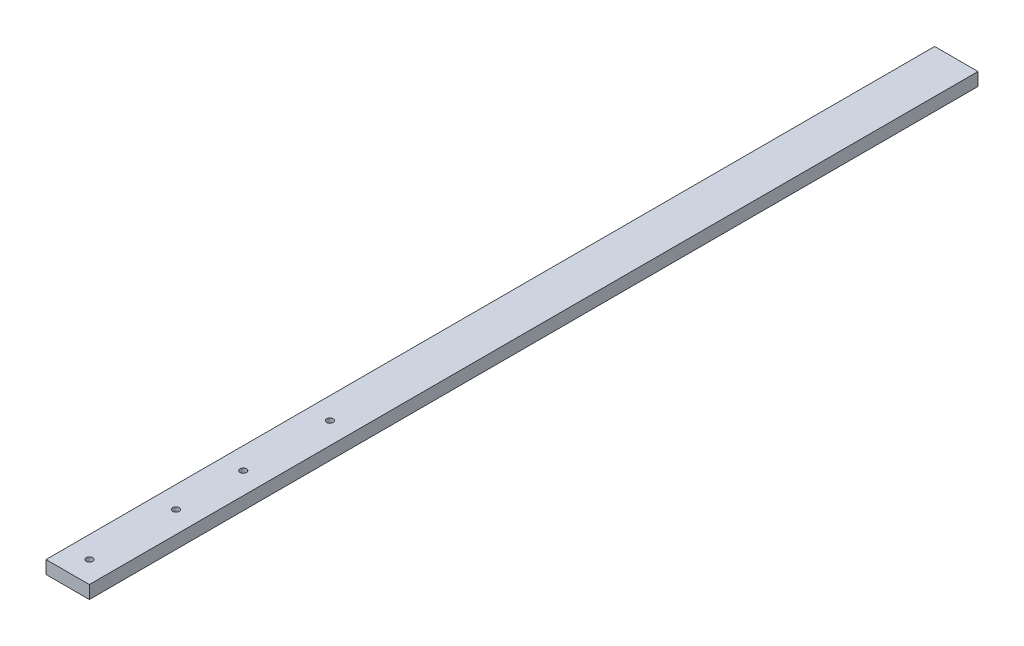
ISO-10303-21;
HEADER;
FILE_DESCRIPTION(('STEP AP214'),'2;1');
FILE_NAME('part.step','',(''),(''),'','','');
FILE_SCHEMA(('AUTOMOTIVE_DESIGN { 1 0 10303 214 1 1 1 1 }'));
ENDSEC;
DATA;
#1=APPLICATION_CONTEXT('core data for automotive mechanical design processes');
#2=APPLICATION_PROTOCOL_DEFINITION('international standard','automotive_design',2000,#1);
#3=PRODUCT_CONTEXT('',#1,'mechanical');
#4=PRODUCT('Part','Part','',(#3));
#5=PRODUCT_RELATED_PRODUCT_CATEGORY('part','',(#4));
#6=PRODUCT_DEFINITION_FORMATION('','',#4);
#7=PRODUCT_DEFINITION_CONTEXT('part definition',#1,'design');
#8=PRODUCT_DEFINITION('design','',#6,#7);
#9=PRODUCT_DEFINITION_SHAPE('','',#8);
#10=(LENGTH_UNIT() NAMED_UNIT(*) SI_UNIT(.MILLI.,.METRE.));
#11=(NAMED_UNIT(*) PLANE_ANGLE_UNIT() SI_UNIT($,.RADIAN.));
#12=(NAMED_UNIT(*) SI_UNIT($,.STERADIAN.) SOLID_ANGLE_UNIT());
#13=UNCERTAINTY_MEASURE_WITH_UNIT(LENGTH_MEASURE(1.E-05),#10,'distance_accuracy_value','');
#14=(GEOMETRIC_REPRESENTATION_CONTEXT(3) GLOBAL_UNCERTAINTY_ASSIGNED_CONTEXT((#13)) GLOBAL_UNIT_ASSIGNED_CONTEXT((#10,
#11,#12)) REPRESENTATION_CONTEXT('',''));
#15=CARTESIAN_POINT('',(0.,0.,0.));
#16=DIRECTION('',(0.,0.,1.));
#17=DIRECTION('',(1.,0.,0.));
#18=AXIS2_PLACEMENT_3D('',#15,#16,#17);
#19=CARTESIAN_POINT('',(-10.,6.,205.));
#20=DIRECTION('',(1.,0.,0.));
#21=DIRECTION('',(0.,0.,-1.));
#22=AXIS2_PLACEMENT_3D('',#19,#20,#21);
#23=PLANE('',#22);
#24=DIRECTION('',(0.,0.,1.));
#25=VECTOR('',#24,1.);
#26=CARTESIAN_POINT('',(-10.,0.,205.));
#27=LINE('',#26,#25);
#28=CARTESIAN_POINT('',(-10.,0.,-204.999999999999));
#29=VERTEX_POINT('',#28);
#30=CARTESIAN_POINT('',(-10.,0.,205.));
#31=VERTEX_POINT('',#30);
#32=EDGE_CURVE('E96',#29,#31,#27,.T.);
#33=ORIENTED_EDGE('',*,*,#32,.T.);
#34=DIRECTION('',(0.,-1.,0.));
#35=VECTOR('',#34,1.);
#36=CARTESIAN_POINT('',(-10.,6.,205.));
#37=LINE('',#36,#35);
#38=CARTESIAN_POINT('',(-10.,6.,205.));
#39=VERTEX_POINT('',#38);
#40=EDGE_CURVE('E11',#39,#31,#37,.T.);
#41=ORIENTED_EDGE('',*,*,#40,.F.);
#42=DIRECTION('',(0.,0.,1.));
#43=VECTOR('',#42,1.);
#44=CARTESIAN_POINT('',(-10.,6.,205.));
#45=LINE('',#44,#43);
#46=CARTESIAN_POINT('',(-10.,6.,-204.999999999999));
#47=VERTEX_POINT('',#46);
#48=EDGE_CURVE('E84',#47,#39,#45,.T.);
#49=ORIENTED_EDGE('',*,*,#48,.F.);
#50=DIRECTION('',(0.,-1.,0.));
#51=VECTOR('',#50,1.);
#52=CARTESIAN_POINT('',(-10.,6.,-204.999999999999));
#53=LINE('',#52,#51);
#54=EDGE_CURVE('E92',#47,#29,#53,.T.);
#55=ORIENTED_EDGE('',*,*,#54,.T.);
#56=EDGE_LOOP('',(#33,#41,#49,#55));
#57=FACE_BOUND('',#56,.T.);
#58=ADVANCED_FACE('F33',(#57),#23,.F.);
#59=CARTESIAN_POINT('',(9.99999999999999,6.,205.));
#60=DIRECTION('',(0.,0.,-1.));
#61=DIRECTION('',(-1.,0.,0.));
#62=AXIS2_PLACEMENT_3D('',#59,#60,#61);
#63=PLANE('',#62);
#64=DIRECTION('',(1.,0.,0.));
#65=VECTOR('',#64,1.);
#66=CARTESIAN_POINT('',(9.99999999999999,0.,205.));
#67=LINE('',#66,#65);
#68=CARTESIAN_POINT('',(9.99999999999999,0.,205.));
#69=VERTEX_POINT('',#68);
#70=EDGE_CURVE('E88',#31,#69,#67,.T.);
#71=ORIENTED_EDGE('',*,*,#70,.T.);
#72=DIRECTION('',(0.,-1.,0.));
#73=VECTOR('',#72,1.);
#74=CARTESIAN_POINT('',(9.99999999999999,6.,205.));
#75=LINE('',#74,#73);
#76=CARTESIAN_POINT('',(9.99999999999999,6.,205.));
#77=VERTEX_POINT('',#76);
#78=EDGE_CURVE('E41',#77,#69,#75,.T.);
#79=ORIENTED_EDGE('',*,*,#78,.F.);
#80=DIRECTION('',(1.,0.,0.));
#81=VECTOR('',#80,1.);
#82=CARTESIAN_POINT('',(9.99999999999999,6.,205.));
#83=LINE('',#82,#81);
#84=EDGE_CURVE('E79',#39,#77,#83,.T.);
#85=ORIENTED_EDGE('',*,*,#84,.F.);
#86=ORIENTED_EDGE('',*,*,#40,.T.);
#87=EDGE_LOOP('',(#71,#79,#85,#86));
#88=FACE_BOUND('',#87,.T.);
#89=ADVANCED_FACE('F87',(#88),#63,.F.);
#90=CARTESIAN_POINT('',(9.99999999999999,6.,205.));
#91=DIRECTION('',(-1.,0.,0.));
#92=DIRECTION('',(0.,0.,1.));
#93=AXIS2_PLACEMENT_3D('',#90,#91,#92);
#94=PLANE('',#93);
#95=DIRECTION('',(0.,0.,-1.));
#96=VECTOR('',#95,1.);
#97=CARTESIAN_POINT('',(9.99999999999999,0.,205.));
#98=LINE('',#97,#96);
#99=CARTESIAN_POINT('',(9.99999999999999,0.,-204.999999999999));
#100=VERTEX_POINT('',#99);
#101=EDGE_CURVE('E66',#69,#100,#98,.T.);
#102=ORIENTED_EDGE('',*,*,#101,.T.);
#103=DIRECTION('',(0.,-1.,0.));
#104=VECTOR('',#103,1.);
#105=CARTESIAN_POINT('',(9.99999999999999,6.,-204.999999999999));
#106=LINE('',#105,#104);
#107=CARTESIAN_POINT('',(9.99999999999999,6.,-204.999999999999));
#108=VERTEX_POINT('',#107);
#109=EDGE_CURVE('E89',#108,#100,#106,.T.);
#110=ORIENTED_EDGE('',*,*,#109,.F.);
#111=DIRECTION('',(0.,0.,-1.));
#112=VECTOR('',#111,1.);
#113=CARTESIAN_POINT('',(9.99999999999999,6.,205.));
#114=LINE('',#113,#112);
#115=EDGE_CURVE('E82',#77,#108,#114,.T.);
#116=ORIENTED_EDGE('',*,*,#115,.F.);
#117=ORIENTED_EDGE('',*,*,#78,.T.);
#118=EDGE_LOOP('',(#102,#110,#116,#117));
#119=FACE_BOUND('',#118,.T.);
#120=ADVANCED_FACE('F90',(#119),#94,.F.);
#121=CARTESIAN_POINT('',(9.99999999999999,6.,-204.999999999999));
#122=DIRECTION('',(0.,0.,1.));
#123=DIRECTION('',(1.,0.,0.));
#124=AXIS2_PLACEMENT_3D('',#121,#122,#123);
#125=PLANE('',#124);
#126=DIRECTION('',(-1.,0.,0.));
#127=VECTOR('',#126,1.);
#128=CARTESIAN_POINT('',(9.99999999999999,0.,-204.999999999999));
#129=LINE('',#128,#127);
#130=EDGE_CURVE('E72',#100,#29,#129,.T.);
#131=ORIENTED_EDGE('',*,*,#130,.T.);
#132=ORIENTED_EDGE('',*,*,#54,.F.);
#133=DIRECTION('',(-1.,0.,0.));
#134=VECTOR('',#133,1.);
#135=CARTESIAN_POINT('',(9.99999999999999,6.,-204.999999999999));
#136=LINE('',#135,#134);
#137=EDGE_CURVE('E49',#108,#47,#136,.T.);
#138=ORIENTED_EDGE('',*,*,#137,.F.);
#139=ORIENTED_EDGE('',*,*,#109,.T.);
#140=EDGE_LOOP('',(#131,#132,#138,#139));
#141=FACE_BOUND('',#140,.T.);
#142=ADVANCED_FACE('F104',(#141),#125,.F.);
#143=CARTESIAN_POINT('',(0.,6.,0.));
#144=DIRECTION('',(0.,1.,0.));
#145=DIRECTION('',(0.,0.,1.));
#146=AXIS2_PLACEMENT_3D('',#143,#144,#145);
#147=PLANE('',#146);
#148=CARTESIAN_POINT('',(0.,6.,195.));
#149=DIRECTION('',(0.,1.,0.));
#150=DIRECTION('',(0.,0.,1.));
#151=AXIS2_PLACEMENT_3D('',#148,#149,#150);
#152=CIRCLE('',#151,1.5);
#153=CARTESIAN_POINT('',(0.,6.,196.5));
#154=VERTEX_POINT('',#153);
#155=EDGE_CURVE('E128',#154,#154,#152,.T.);
#156=ORIENTED_EDGE('',*,*,#155,.F.);
#157=EDGE_LOOP('',(#156));
#158=FACE_BOUND('',#157,.T.);
#159=CARTESIAN_POINT('',(0.,6.,155.));
#160=DIRECTION('',(0.,1.,0.));
#161=DIRECTION('',(0.,0.,1.));
#162=AXIS2_PLACEMENT_3D('',#159,#160,#161);
#163=CIRCLE('',#162,1.5);
#164=CARTESIAN_POINT('',(0.,6.,156.5));
#165=VERTEX_POINT('',#164);
#166=EDGE_CURVE('E122',#165,#165,#163,.T.);
#167=ORIENTED_EDGE('',*,*,#166,.F.);
#168=EDGE_LOOP('',(#167));
#169=FACE_BOUND('',#168,.T.);
#170=CARTESIAN_POINT('',(0.,6.,124.));
#171=DIRECTION('',(0.,1.,0.));
#172=DIRECTION('',(0.,0.,1.));
#173=AXIS2_PLACEMENT_3D('',#170,#171,#172);
#174=CIRCLE('',#173,1.5);
#175=CARTESIAN_POINT('',(0.,6.,125.5));
#176=VERTEX_POINT('',#175);
#177=EDGE_CURVE('E116',#176,#176,#174,.T.);
#178=ORIENTED_EDGE('',*,*,#177,.F.);
#179=EDGE_LOOP('',(#178));
#180=FACE_BOUND('',#179,.T.);
#181=CARTESIAN_POINT('',(0.,6.,84.0000000000004));
#182=DIRECTION('',(0.,1.,0.));
#183=DIRECTION('',(0.,0.,1.));
#184=AXIS2_PLACEMENT_3D('',#181,#182,#183);
#185=CIRCLE('',#184,1.5);
#186=CARTESIAN_POINT('',(0.,6.,85.5000000000004));
#187=VERTEX_POINT('',#186);
#188=EDGE_CURVE('E110',#187,#187,#185,.T.);
#189=ORIENTED_EDGE('',*,*,#188,.F.);
#190=EDGE_LOOP('',(#189));
#191=FACE_BOUND('',#190,.T.);
#192=ORIENTED_EDGE('',*,*,#48,.T.);
#193=ORIENTED_EDGE('',*,*,#84,.T.);
#194=ORIENTED_EDGE('',*,*,#115,.T.);
#195=ORIENTED_EDGE('',*,*,#137,.T.);
#196=EDGE_LOOP('',(#192,#193,#194,#195));
#197=FACE_BOUND('',#196,.T.);
#198=ADVANCED_FACE('F80',(#158,#169,#180,#191,#197),#147,.T.);
#199=CARTESIAN_POINT('',(0.,0.,0.));
#200=DIRECTION('',(0.,1.,0.));
#201=DIRECTION('',(0.,0.,1.));
#202=AXIS2_PLACEMENT_3D('',#199,#200,#201);
#203=PLANE('',#202);
#204=CARTESIAN_POINT('',(0.,0.,195.));
#205=DIRECTION('',(0.,1.,0.));
#206=DIRECTION('',(0.,0.,1.));
#207=AXIS2_PLACEMENT_3D('',#204,#205,#206);
#208=CIRCLE('',#207,1.5);
#209=CARTESIAN_POINT('',(0.,0.,196.5));
#210=VERTEX_POINT('',#209);
#211=EDGE_CURVE('E99',#210,#210,#208,.T.);
#212=ORIENTED_EDGE('',*,*,#211,.T.);
#213=EDGE_LOOP('',(#212));
#214=FACE_BOUND('',#213,.T.);
#215=CARTESIAN_POINT('',(0.,0.,155.));
#216=DIRECTION('',(0.,1.,0.));
#217=DIRECTION('',(0.,0.,1.));
#218=AXIS2_PLACEMENT_3D('',#215,#216,#217);
#219=CIRCLE('',#218,1.5);
#220=CARTESIAN_POINT('',(0.,0.,156.5));
#221=VERTEX_POINT('',#220);
#222=EDGE_CURVE('E125',#221,#221,#219,.T.);
#223=ORIENTED_EDGE('',*,*,#222,.T.);
#224=EDGE_LOOP('',(#223));
#225=FACE_BOUND('',#224,.T.);
#226=CARTESIAN_POINT('',(0.,0.,124.));
#227=DIRECTION('',(0.,1.,0.));
#228=DIRECTION('',(0.,0.,1.));
#229=AXIS2_PLACEMENT_3D('',#226,#227,#228);
#230=CIRCLE('',#229,1.5);
#231=CARTESIAN_POINT('',(0.,0.,125.5));
#232=VERTEX_POINT('',#231);
#233=EDGE_CURVE('E119',#232,#232,#230,.T.);
#234=ORIENTED_EDGE('',*,*,#233,.T.);
#235=EDGE_LOOP('',(#234));
#236=FACE_BOUND('',#235,.T.);
#237=CARTESIAN_POINT('',(0.,0.,84.0000000000004));
#238=DIRECTION('',(0.,1.,0.));
#239=DIRECTION('',(0.,0.,1.));
#240=AXIS2_PLACEMENT_3D('',#237,#238,#239);
#241=CIRCLE('',#240,1.5);
#242=CARTESIAN_POINT('',(0.,0.,85.5000000000004));
#243=VERTEX_POINT('',#242);
#244=EDGE_CURVE('E113',#243,#243,#241,.T.);
#245=ORIENTED_EDGE('',*,*,#244,.T.);
#246=EDGE_LOOP('',(#245));
#247=FACE_BOUND('',#246,.T.);
#248=ORIENTED_EDGE('',*,*,#32,.F.);
#249=ORIENTED_EDGE('',*,*,#130,.F.);
#250=ORIENTED_EDGE('',*,*,#101,.F.);
#251=ORIENTED_EDGE('',*,*,#70,.F.);
#252=EDGE_LOOP('',(#248,#249,#250,#251));
#253=FACE_BOUND('',#252,.T.);
#254=ADVANCED_FACE('F107',(#214,#225,#236,#247,#253),#203,.F.);
#255=CARTESIAN_POINT('',(0.,0.,84.0000000000004));
#256=DIRECTION('',(0.,1.,0.));
#257=DIRECTION('',(0.,0.,1.));
#258=AXIS2_PLACEMENT_3D('',#255,#256,#257);
#259=CYLINDRICAL_SURFACE('',#258,1.5);
#260=ORIENTED_EDGE('',*,*,#244,.F.);
#261=EDGE_LOOP('',(#260));
#262=FACE_BOUND('',#261,.T.);
#263=ORIENTED_EDGE('',*,*,#188,.T.);
#264=EDGE_LOOP('',(#263));
#265=FACE_BOUND('',#264,.T.);
#266=ADVANCED_FACE('F152',(#262,#265),#259,.F.);
#267=CARTESIAN_POINT('',(0.,0.,124.));
#268=DIRECTION('',(0.,1.,0.));
#269=DIRECTION('',(0.,0.,1.));
#270=AXIS2_PLACEMENT_3D('',#267,#268,#269);
#271=CYLINDRICAL_SURFACE('',#270,1.5);
#272=ORIENTED_EDGE('',*,*,#233,.F.);
#273=EDGE_LOOP('',(#272));
#274=FACE_BOUND('',#273,.T.);
#275=ORIENTED_EDGE('',*,*,#177,.T.);
#276=EDGE_LOOP('',(#275));
#277=FACE_BOUND('',#276,.T.);
#278=ADVANCED_FACE('F154',(#274,#277),#271,.F.);
#279=CARTESIAN_POINT('',(0.,0.,155.));
#280=DIRECTION('',(0.,1.,0.));
#281=DIRECTION('',(0.,0.,1.));
#282=AXIS2_PLACEMENT_3D('',#279,#280,#281);
#283=CYLINDRICAL_SURFACE('',#282,1.5);
#284=ORIENTED_EDGE('',*,*,#222,.F.);
#285=EDGE_LOOP('',(#284));
#286=FACE_BOUND('',#285,.T.);
#287=ORIENTED_EDGE('',*,*,#166,.T.);
#288=EDGE_LOOP('',(#287));
#289=FACE_BOUND('',#288,.T.);
#290=ADVANCED_FACE('F139',(#286,#289),#283,.F.);
#291=CARTESIAN_POINT('',(0.,0.,195.));
#292=DIRECTION('',(0.,1.,0.));
#293=DIRECTION('',(0.,0.,1.));
#294=AXIS2_PLACEMENT_3D('',#291,#292,#293);
#295=CYLINDRICAL_SURFACE('',#294,1.5);
#296=ORIENTED_EDGE('',*,*,#211,.F.);
#297=EDGE_LOOP('',(#296));
#298=FACE_BOUND('',#297,.T.);
#299=ORIENTED_EDGE('',*,*,#155,.T.);
#300=EDGE_LOOP('',(#299));
#301=FACE_BOUND('',#300,.T.);
#302=ADVANCED_FACE('F136',(#298,#301),#295,.F.);
#303=CLOSED_SHELL('',(#58,#89,#120,#142,#198,#254,#266,#278,#290,#302));
#304=MANIFOLD_SOLID_BREP('B2',#303);
#305=ADVANCED_BREP_SHAPE_REPRESENTATION('',(#18,#304),#14);
#306=SHAPE_DEFINITION_REPRESENTATION(#9,#305);
ENDSEC;
END-ISO-10303-21;
